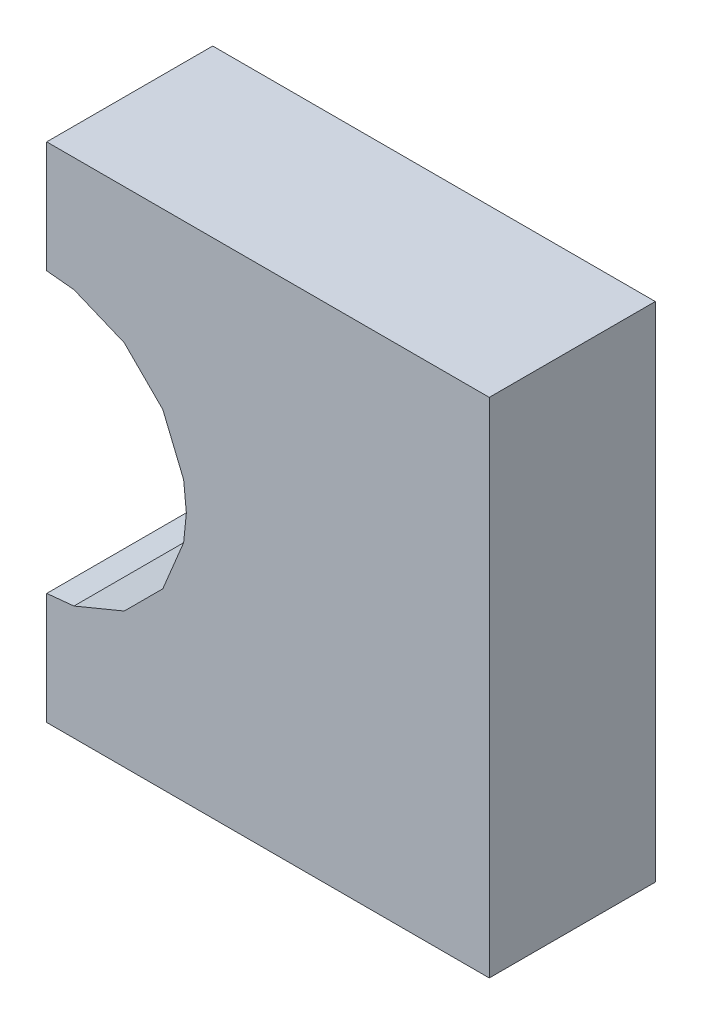
ISO-10303-21;
HEADER;
FILE_DESCRIPTION(('STEP AP214'),'2;1');
FILE_NAME('part.step','',(''),(''),'','','');
FILE_SCHEMA(('AUTOMOTIVE_DESIGN { 1 0 10303 214 1 1 1 1 }'));
ENDSEC;
DATA;
#1=APPLICATION_CONTEXT('core data for automotive mechanical design processes');
#2=APPLICATION_PROTOCOL_DEFINITION('international standard','automotive_design',2000,#1);
#3=PRODUCT_CONTEXT('',#1,'mechanical');
#4=PRODUCT('Part','Part','',(#3));
#5=PRODUCT_RELATED_PRODUCT_CATEGORY('part','',(#4));
#6=PRODUCT_DEFINITION_FORMATION('','',#4);
#7=PRODUCT_DEFINITION_CONTEXT('part definition',#1,'design');
#8=PRODUCT_DEFINITION('design','',#6,#7);
#9=PRODUCT_DEFINITION_SHAPE('','',#8);
#10=(LENGTH_UNIT() NAMED_UNIT(*) SI_UNIT(.MILLI.,.METRE.));
#11=(NAMED_UNIT(*) PLANE_ANGLE_UNIT() SI_UNIT($,.RADIAN.));
#12=(NAMED_UNIT(*) SI_UNIT($,.STERADIAN.) SOLID_ANGLE_UNIT());
#13=UNCERTAINTY_MEASURE_WITH_UNIT(LENGTH_MEASURE(1.E-05),#10,'distance_accuracy_value','');
#14=(GEOMETRIC_REPRESENTATION_CONTEXT(3) GLOBAL_UNCERTAINTY_ASSIGNED_CONTEXT((#13)) GLOBAL_UNIT_ASSIGNED_CONTEXT((#10,
#11,#12)) REPRESENTATION_CONTEXT('',''));
#15=CARTESIAN_POINT('',(0.,0.,0.));
#16=DIRECTION('',(0.,0.,1.));
#17=DIRECTION('',(1.,0.,0.));
#18=AXIS2_PLACEMENT_3D('',#15,#16,#17);
#19=CARTESIAN_POINT('',(0.001594846921477,3.9356421094E-06,0.1499997));
#20=DIRECTION('',(0.,0.,1.));
#21=DIRECTION('',(1.,0.,0.));
#22=AXIS2_PLACEMENT_3D('',#19,#20,#21);
#23=PLANE('',#22);
#24=DIRECTION('',(1.,0.,0.));
#25=VECTOR('',#24,1.);
#26=CARTESIAN_POINT('',(-0.19994118,-0.2271776,0.1499997));
#27=LINE('',#26,#25);
#28=CARTESIAN_POINT('',(-0.19994118,-0.2271776,0.1499997));
#29=VERTEX_POINT('',#28);
#30=CARTESIAN_POINT('',(0.19994626,-0.2271776,0.1499997));
#31=VERTEX_POINT('',#30);
#32=EDGE_CURVE('E20',#29,#31,#27,.T.);
#33=ORIENTED_EDGE('',*,*,#32,.T.);
#34=DIRECTION('',(0.,1.,0.));
#35=VECTOR('',#34,1.);
#36=CARTESIAN_POINT('',(0.19994626,-0.2271776,0.1499997));
#37=LINE('',#36,#35);
#38=CARTESIAN_POINT('',(0.19994626,0.22718014,0.1499997));
#39=VERTEX_POINT('',#38);
#40=EDGE_CURVE('E200',#31,#39,#37,.T.);
#41=ORIENTED_EDGE('',*,*,#40,.T.);
#42=DIRECTION('',(-1.,0.,0.));
#43=VECTOR('',#42,1.);
#44=CARTESIAN_POINT('',(0.19994626,0.22718014,0.1499997));
#45=LINE('',#44,#43);
#46=CARTESIAN_POINT('',(-0.19994118,0.22718014,0.1499997));
#47=VERTEX_POINT('',#46);
#48=EDGE_CURVE('E232',#39,#47,#45,.T.);
#49=ORIENTED_EDGE('',*,*,#48,.T.);
#50=DIRECTION('',(-2.51648293148192E-05,-0.999999999683366,0.));
#51=VECTOR('',#50,1.);
#52=CARTESIAN_POINT('',(-0.19994118,0.22718014,0.1499997));
#53=LINE('',#52,#51);
#54=CARTESIAN_POINT('',(-0.19994372,0.12624562,0.1499997));
#55=VERTEX_POINT('',#54);
#56=EDGE_CURVE('E112',#47,#55,#53,.T.);
#57=ORIENTED_EDGE('',*,*,#56,.T.);
#58=DIRECTION('',(0.995178530513557,-0.0980800306121363,0.));
#59=VECTOR('',#58,1.);
#60=CARTESIAN_POINT('',(-0.19994372,0.12624562,0.1499997));
#61=LINE('',#60,#59);
#62=CARTESIAN_POINT('',(-0.17533112,0.12381992,0.1499997));
#63=VERTEX_POINT('',#62);
#64=EDGE_CURVE('E92',#55,#63,#61,.T.);
#65=ORIENTED_EDGE('',*,*,#64,.T.);
#66=DIRECTION('',(0.92387029835817,-0.38270572482207,0.));
#67=VECTOR('',#66,1.);
#68=CARTESIAN_POINT('',(-0.17533112,0.12381992,0.1499997));
#69=LINE('',#68,#67);
#70=CARTESIAN_POINT('',(-0.12985242,0.10498074,0.1499997));
#71=VERTEX_POINT('',#70);
#72=EDGE_CURVE('E207',#63,#71,#69,.T.);
#73=ORIENTED_EDGE('',*,*,#72,.T.);
#74=DIRECTION('',(0.707106781187048,-0.707106781186048,0.));
#75=VECTOR('',#74,1.);
#76=CARTESIAN_POINT('',(-0.12985242,0.10498074,0.1499997));
#77=LINE('',#76,#75);
#78=CARTESIAN_POINT('',(-0.09504426000001,0.07017258000002,0.1499997));
#79=VERTEX_POINT('',#78);
#80=EDGE_CURVE('E217',#71,#79,#77,.T.);
#81=ORIENTED_EDGE('',*,*,#80,.T.);
#82=DIRECTION('',(0.382705724820863,-0.92387029835867,0.));
#83=VECTOR('',#82,1.);
#84=CARTESIAN_POINT('',(-0.09504426000001,0.07017258000002,0.1499997));
#85=LINE('',#84,#83);
#86=CARTESIAN_POINT('',(-0.07620508000002,0.02469388,0.1499997));
#87=VERTEX_POINT('',#86);
#88=EDGE_CURVE('E201',#79,#87,#85,.T.);
#89=ORIENTED_EDGE('',*,*,#88,.T.);
#90=DIRECTION('',(0.0980800306154527,-0.99517853051323,0.));
#91=VECTOR('',#90,1.);
#92=CARTESIAN_POINT('',(-0.07620508000002,0.02469388,0.1499997));
#93=LINE('',#92,#91);
#94=CARTESIAN_POINT('',(-0.07377937999996,8.127999998919E-05,0.1499997));
#95=VERTEX_POINT('',#94);
#96=EDGE_CURVE('E218',#87,#95,#93,.T.);
#97=ORIENTED_EDGE('',*,*,#96,.T.);
#98=DIRECTION('',(0.,-1.,0.));
#99=VECTOR('',#98,1.);
#100=CARTESIAN_POINT('',(-0.07377937999996,8.127999998919E-05,0.1499997));
#101=LINE('',#100,#99);
#102=CARTESIAN_POINT('',(-0.07377937999996,-2.540000025419E-06,0.1499997));
#103=VERTEX_POINT('',#102);
#104=EDGE_CURVE('E255',#95,#103,#101,.T.);
#105=ORIENTED_EDGE('',*,*,#104,.T.);
#106=DIRECTION('',(-0.098070007225142,-0.995179518319615,0.));
#107=VECTOR('',#106,1.);
#108=CARTESIAN_POINT('',(-0.07377937999996,-2.540000025419E-06,0.1499997));
#109=LINE('',#108,#107);
#110=CARTESIAN_POINT('',(-0.07620508000002,-0.02461768000001,0.1499997));
#111=VERTEX_POINT('',#110);
#112=EDGE_CURVE('E235',#103,#111,#109,.T.);
#113=ORIENTED_EDGE('',*,*,#112,.T.);
#114=DIRECTION('',(-0.38266168236186,-0.923888541357663,0.));
#115=VECTOR('',#114,1.);
#116=CARTESIAN_POINT('',(-0.07620508000002,-0.02461768000001,0.1499997));
#117=LINE('',#116,#115);
#118=CARTESIAN_POINT('',(-0.09504171999998,-0.07009638,0.1499997));
#119=VERTEX_POINT('',#118);
#120=EDGE_CURVE('E190',#111,#119,#117,.T.);
#121=ORIENTED_EDGE('',*,*,#120,.T.);
#122=DIRECTION('',(-0.707106781186548,-0.707106781186548,0.));
#123=VECTOR('',#122,1.);
#124=CARTESIAN_POINT('',(-0.09504171999998,-0.07009638,0.1499997));
#125=LINE('',#124,#123);
#126=CARTESIAN_POINT('',(-0.12984988,-0.10490454,0.1499997));
#127=VERTEX_POINT('',#126);
#128=EDGE_CURVE('E169',#119,#127,#125,.T.);
#129=ORIENTED_EDGE('',*,*,#128,.T.);
#130=DIRECTION('',(-0.923888541357163,-0.382661682363068,0.));
#131=VECTOR('',#130,1.);
#132=CARTESIAN_POINT('',(-0.12984988,-0.10490454,0.1499997));
#133=LINE('',#132,#131);
#134=CARTESIAN_POINT('',(-0.17532858,-0.12374118,0.1499997));
#135=VERTEX_POINT('',#134);
#136=EDGE_CURVE('E166',#127,#135,#133,.T.);
#137=ORIENTED_EDGE('',*,*,#136,.T.);
#138=DIRECTION('',(-0.995188549826162,-0.0979783154320458,0.));
#139=VECTOR('',#138,1.);
#140=CARTESIAN_POINT('',(-0.17532858,-0.12374118,0.1499997));
#141=LINE('',#140,#139);
#142=CARTESIAN_POINT('',(-0.19994118,-0.12616434,0.1499997));
#143=VERTEX_POINT('',#142);
#144=EDGE_CURVE('E154',#135,#143,#141,.T.);
#145=ORIENTED_EDGE('',*,*,#144,.T.);
#146=DIRECTION('',(0.,-1.,0.));
#147=VECTOR('',#146,1.);
#148=CARTESIAN_POINT('',(-0.19994118,-0.12616434,0.1499997));
#149=LINE('',#148,#147);
#150=EDGE_CURVE('E11',#143,#29,#149,.T.);
#151=ORIENTED_EDGE('',*,*,#150,.T.);
#152=EDGE_LOOP('',(#33,#41,#49,#57,#65,#73,#81,#89,#97,#105,#113,#121,#129,#137,#145,#151));
#153=FACE_BOUND('',#152,.T.);
#154=ADVANCED_FACE('F16',(#153),#23,.T.);
#155=CARTESIAN_POINT('',(0.001594846921477,3.9356421094E-06,0.));
#156=DIRECTION('',(0.,0.,1.));
#157=DIRECTION('',(1.,0.,0.));
#158=AXIS2_PLACEMENT_3D('',#155,#156,#157);
#159=PLANE('',#158);
#160=DIRECTION('',(1.,0.,0.));
#161=VECTOR('',#160,1.);
#162=CARTESIAN_POINT('',(-0.19994118,-0.2271776,0.));
#163=LINE('',#162,#161);
#164=CARTESIAN_POINT('',(-0.19994118,-0.2271776,0.));
#165=VERTEX_POINT('',#164);
#166=CARTESIAN_POINT('',(0.19994626,-0.2271776,0.));
#167=VERTEX_POINT('',#166);
#168=EDGE_CURVE('E244',#165,#167,#163,.T.);
#169=ORIENTED_EDGE('',*,*,#168,.F.);
#170=DIRECTION('',(0.,-1.,0.));
#171=VECTOR('',#170,1.);
#172=CARTESIAN_POINT('',(-0.19994118,-0.12616434,0.));
#173=LINE('',#172,#171);
#174=CARTESIAN_POINT('',(-0.19994118,-0.12616434,0.));
#175=VERTEX_POINT('',#174);
#176=EDGE_CURVE('E27',#175,#165,#173,.T.);
#177=ORIENTED_EDGE('',*,*,#176,.F.);
#178=DIRECTION('',(-0.995188549826162,-0.0979783154320458,0.));
#179=VECTOR('',#178,1.);
#180=CARTESIAN_POINT('',(-0.17532858,-0.12374118,0.));
#181=LINE('',#180,#179);
#182=CARTESIAN_POINT('',(-0.17532858,-0.12374118,0.));
#183=VERTEX_POINT('',#182);
#184=EDGE_CURVE('E174',#183,#175,#181,.T.);
#185=ORIENTED_EDGE('',*,*,#184,.F.);
#186=DIRECTION('',(-0.923888541357163,-0.382661682363068,0.));
#187=VECTOR('',#186,1.);
#188=CARTESIAN_POINT('',(-0.12984988,-0.10490454,0.));
#189=LINE('',#188,#187);
#190=CARTESIAN_POINT('',(-0.12984988,-0.10490454,0.));
#191=VERTEX_POINT('',#190);
#192=EDGE_CURVE('E178',#191,#183,#189,.T.);
#193=ORIENTED_EDGE('',*,*,#192,.F.);
#194=DIRECTION('',(-0.707106781186548,-0.707106781186548,0.));
#195=VECTOR('',#194,1.);
#196=CARTESIAN_POINT('',(-0.09504171999998,-0.07009638,0.));
#197=LINE('',#196,#195);
#198=CARTESIAN_POINT('',(-0.09504171999998,-0.07009638,0.));
#199=VERTEX_POINT('',#198);
#200=EDGE_CURVE('E193',#199,#191,#197,.T.);
#201=ORIENTED_EDGE('',*,*,#200,.F.);
#202=DIRECTION('',(-0.38266168236186,-0.923888541357663,0.));
#203=VECTOR('',#202,1.);
#204=CARTESIAN_POINT('',(-0.07620508000002,-0.02461768000001,0.));
#205=LINE('',#204,#203);
#206=CARTESIAN_POINT('',(-0.07620508000002,-0.02461768000001,0.));
#207=VERTEX_POINT('',#206);
#208=EDGE_CURVE('E239',#207,#199,#205,.T.);
#209=ORIENTED_EDGE('',*,*,#208,.F.);
#210=DIRECTION('',(-0.098070007225142,-0.995179518319615,0.));
#211=VECTOR('',#210,1.);
#212=CARTESIAN_POINT('',(-0.07377937999996,-2.540000025419E-06,0.));
#213=LINE('',#212,#211);
#214=CARTESIAN_POINT('',(-0.07377937999996,-2.540000025419E-06,0.));
#215=VERTEX_POINT('',#214);
#216=EDGE_CURVE('E247',#215,#207,#213,.T.);
#217=ORIENTED_EDGE('',*,*,#216,.F.);
#218=DIRECTION('',(0.,-1.,0.));
#219=VECTOR('',#218,1.);
#220=CARTESIAN_POINT('',(-0.07377937999996,8.127999998919E-05,0.));
#221=LINE('',#220,#219);
#222=CARTESIAN_POINT('',(-0.07377937999996,8.127999998919E-05,0.));
#223=VERTEX_POINT('',#222);
#224=EDGE_CURVE('E222',#223,#215,#221,.T.);
#225=ORIENTED_EDGE('',*,*,#224,.F.);
#226=DIRECTION('',(0.0980800306154527,-0.99517853051323,0.));
#227=VECTOR('',#226,1.);
#228=CARTESIAN_POINT('',(-0.07620508000002,0.02469388,0.));
#229=LINE('',#228,#227);
#230=CARTESIAN_POINT('',(-0.07620508000002,0.02469388,0.));
#231=VERTEX_POINT('',#230);
#232=EDGE_CURVE('E205',#231,#223,#229,.T.);
#233=ORIENTED_EDGE('',*,*,#232,.F.);
#234=DIRECTION('',(0.382705724820863,-0.92387029835867,0.));
#235=VECTOR('',#234,1.);
#236=CARTESIAN_POINT('',(-0.09504426000001,0.07017258000002,0.));
#237=LINE('',#236,#235);
#238=CARTESIAN_POINT('',(-0.09504426000001,0.07017258000002,0.));
#239=VERTEX_POINT('',#238);
#240=EDGE_CURVE('E270',#239,#231,#237,.T.);
#241=ORIENTED_EDGE('',*,*,#240,.F.);
#242=DIRECTION('',(0.707106781187048,-0.707106781186048,0.));
#243=VECTOR('',#242,1.);
#244=CARTESIAN_POINT('',(-0.12985242,0.10498074,0.));
#245=LINE('',#244,#243);
#246=CARTESIAN_POINT('',(-0.12985242,0.10498074,0.));
#247=VERTEX_POINT('',#246);
#248=EDGE_CURVE('E211',#247,#239,#245,.T.);
#249=ORIENTED_EDGE('',*,*,#248,.F.);
#250=DIRECTION('',(0.92387029835817,-0.38270572482207,0.));
#251=VECTOR('',#250,1.);
#252=CARTESIAN_POINT('',(-0.17533112,0.12381992,0.));
#253=LINE('',#252,#251);
#254=CARTESIAN_POINT('',(-0.17533112,0.12381992,0.));
#255=VERTEX_POINT('',#254);
#256=EDGE_CURVE('E278',#255,#247,#253,.T.);
#257=ORIENTED_EDGE('',*,*,#256,.F.);
#258=DIRECTION('',(0.995178530513557,-0.0980800306121363,0.));
#259=VECTOR('',#258,1.);
#260=CARTESIAN_POINT('',(-0.19994372,0.12624562,0.));
#261=LINE('',#260,#259);
#262=CARTESIAN_POINT('',(-0.19994372,0.12624562,0.));
#263=VERTEX_POINT('',#262);
#264=EDGE_CURVE('E102',#263,#255,#261,.T.);
#265=ORIENTED_EDGE('',*,*,#264,.F.);
#266=DIRECTION('',(-2.51648293148192E-05,-0.999999999683366,0.));
#267=VECTOR('',#266,1.);
#268=CARTESIAN_POINT('',(-0.19994118,0.22718014,0.));
#269=LINE('',#268,#267);
#270=CARTESIAN_POINT('',(-0.19994118,0.22718014,0.));
#271=VERTEX_POINT('',#270);
#272=EDGE_CURVE('E227',#271,#263,#269,.T.);
#273=ORIENTED_EDGE('',*,*,#272,.F.);
#274=DIRECTION('',(-1.,0.,0.));
#275=VECTOR('',#274,1.);
#276=CARTESIAN_POINT('',(0.19994626,0.22718014,0.));
#277=LINE('',#276,#275);
#278=CARTESIAN_POINT('',(0.19994626,0.22718014,0.));
#279=VERTEX_POINT('',#278);
#280=EDGE_CURVE('E195',#279,#271,#277,.T.);
#281=ORIENTED_EDGE('',*,*,#280,.F.);
#282=DIRECTION('',(0.,1.,0.));
#283=VECTOR('',#282,1.);
#284=CARTESIAN_POINT('',(0.19994626,-0.2271776,0.));
#285=LINE('',#284,#283);
#286=EDGE_CURVE('E346',#167,#279,#285,.T.);
#287=ORIENTED_EDGE('',*,*,#286,.F.);
#288=EDGE_LOOP('',(#169,#177,#185,#193,#201,#209,#217,#225,#233,#241,#249,#257,#265,#273,#281,#287));
#289=FACE_BOUND('',#288,.T.);
#290=ADVANCED_FACE('F370',(#289),#159,.F.);
#291=CARTESIAN_POINT('',(-0.19994118,-0.12616434,0.));
#292=DIRECTION('',(1.,0.,0.));
#293=DIRECTION('',(0.,1.,0.));
#294=AXIS2_PLACEMENT_3D('',#291,#292,#293);
#295=PLANE('',#294);
#296=DIRECTION('',(0.,0.,1.));
#297=VECTOR('',#296,1.);
#298=CARTESIAN_POINT('',(-0.19994118,-0.12616434,0.));
#299=LINE('',#298,#297);
#300=EDGE_CURVE('E161',#175,#143,#299,.T.);
#301=ORIENTED_EDGE('',*,*,#300,.F.);
#302=ORIENTED_EDGE('',*,*,#176,.T.);
#303=DIRECTION('',(0.,0.,1.));
#304=VECTOR('',#303,1.);
#305=CARTESIAN_POINT('',(-0.19994118,-0.2271776,0.));
#306=LINE('',#305,#304);
#307=EDGE_CURVE('E308',#165,#29,#306,.T.);
#308=ORIENTED_EDGE('',*,*,#307,.T.);
#309=ORIENTED_EDGE('',*,*,#150,.F.);
#310=EDGE_LOOP('',(#301,#302,#308,#309));
#311=FACE_BOUND('',#310,.T.);
#312=ADVANCED_FACE('F385',(#311),#295,.F.);
#313=CARTESIAN_POINT('',(-0.17532858,-0.12374118,0.));
#314=DIRECTION('',(0.0979783154320458,-0.995188549826162,0.));
#315=DIRECTION('',(0.,0.,-1.));
#316=AXIS2_PLACEMENT_3D('',#313,#314,#315);
#317=PLANE('',#316);
#318=DIRECTION('',(0.,0.,1.));
#319=VECTOR('',#318,1.);
#320=CARTESIAN_POINT('',(-0.17532858,-0.12374118,0.));
#321=LINE('',#320,#319);
#322=EDGE_CURVE('E159',#183,#135,#321,.T.);
#323=ORIENTED_EDGE('',*,*,#322,.F.);
#324=ORIENTED_EDGE('',*,*,#184,.T.);
#325=ORIENTED_EDGE('',*,*,#300,.T.);
#326=ORIENTED_EDGE('',*,*,#144,.F.);
#327=EDGE_LOOP('',(#323,#324,#325,#326));
#328=FACE_BOUND('',#327,.T.);
#329=ADVANCED_FACE('F156',(#328),#317,.F.);
#330=CARTESIAN_POINT('',(-0.12984988,-0.10490454,0.));
#331=DIRECTION('',(0.382661682363068,-0.923888541357163,0.));
#332=DIRECTION('',(0.,0.,-1.));
#333=AXIS2_PLACEMENT_3D('',#330,#331,#332);
#334=PLANE('',#333);
#335=DIRECTION('',(0.,0.,1.));
#336=VECTOR('',#335,1.);
#337=CARTESIAN_POINT('',(-0.12984988,-0.10490454,0.));
#338=LINE('',#337,#336);
#339=EDGE_CURVE('E231',#191,#127,#338,.T.);
#340=ORIENTED_EDGE('',*,*,#339,.F.);
#341=ORIENTED_EDGE('',*,*,#192,.T.);
#342=ORIENTED_EDGE('',*,*,#322,.T.);
#343=ORIENTED_EDGE('',*,*,#136,.F.);
#344=EDGE_LOOP('',(#340,#341,#342,#343));
#345=FACE_BOUND('',#344,.T.);
#346=ADVANCED_FACE('F176',(#345),#334,.F.);
#347=CARTESIAN_POINT('',(-0.09504171999998,-0.07009638,0.));
#348=DIRECTION('',(0.707106781186548,-0.707106781186548,0.));
#349=DIRECTION('',(0.,0.,-1.));
#350=AXIS2_PLACEMENT_3D('',#347,#348,#349);
#351=PLANE('',#350);
#352=DIRECTION('',(0.,0.,1.));
#353=VECTOR('',#352,1.);
#354=CARTESIAN_POINT('',(-0.09504171999998,-0.07009638,0.));
#355=LINE('',#354,#353);
#356=EDGE_CURVE('E194',#199,#119,#355,.T.);
#357=ORIENTED_EDGE('',*,*,#356,.F.);
#358=ORIENTED_EDGE('',*,*,#200,.T.);
#359=ORIENTED_EDGE('',*,*,#339,.T.);
#360=ORIENTED_EDGE('',*,*,#128,.F.);
#361=EDGE_LOOP('',(#357,#358,#359,#360));
#362=FACE_BOUND('',#361,.T.);
#363=ADVANCED_FACE('F523',(#362),#351,.F.);
#364=CARTESIAN_POINT('',(-0.07620508000002,-0.02461768000001,0.));
#365=DIRECTION('',(0.923888541357663,-0.382661682361861,0.));
#366=DIRECTION('',(0.,0.,-1.));
#367=AXIS2_PLACEMENT_3D('',#364,#365,#366);
#368=PLANE('',#367);
#369=DIRECTION('',(0.,0.,1.));
#370=VECTOR('',#369,1.);
#371=CARTESIAN_POINT('',(-0.07620508000002,-0.02461768000001,0.));
#372=LINE('',#371,#370);
#373=EDGE_CURVE('E240',#207,#111,#372,.T.);
#374=ORIENTED_EDGE('',*,*,#373,.F.);
#375=ORIENTED_EDGE('',*,*,#208,.T.);
#376=ORIENTED_EDGE('',*,*,#356,.T.);
#377=ORIENTED_EDGE('',*,*,#120,.F.);
#378=EDGE_LOOP('',(#374,#375,#376,#377));
#379=FACE_BOUND('',#378,.T.);
#380=ADVANCED_FACE('F538',(#379),#368,.F.);
#381=CARTESIAN_POINT('',(-0.07377937999996,-2.540000025419E-06,0.));
#382=DIRECTION('',(0.995179518319615,-0.098070007225142,0.));
#383=DIRECTION('',(0.,0.,-1.));
#384=AXIS2_PLACEMENT_3D('',#381,#382,#383);
#385=PLANE('',#384);
#386=DIRECTION('',(0.,0.,1.));
#387=VECTOR('',#386,1.);
#388=CARTESIAN_POINT('',(-0.07377937999996,-2.540000025419E-06,0.));
#389=LINE('',#388,#387);
#390=EDGE_CURVE('E188',#215,#103,#389,.T.);
#391=ORIENTED_EDGE('',*,*,#390,.F.);
#392=ORIENTED_EDGE('',*,*,#216,.T.);
#393=ORIENTED_EDGE('',*,*,#373,.T.);
#394=ORIENTED_EDGE('',*,*,#112,.F.);
#395=EDGE_LOOP('',(#391,#392,#393,#394));
#396=FACE_BOUND('',#395,.T.);
#397=ADVANCED_FACE('F330',(#396),#385,.F.);
#398=CARTESIAN_POINT('',(-0.07377937999996,8.127999998919E-05,0.));
#399=DIRECTION('',(1.,0.,0.));
#400=DIRECTION('',(0.,1.,0.));
#401=AXIS2_PLACEMENT_3D('',#398,#399,#400);
#402=PLANE('',#401);
#403=DIRECTION('',(0.,0.,1.));
#404=VECTOR('',#403,1.);
#405=CARTESIAN_POINT('',(-0.07377937999996,8.127999998919E-05,0.));
#406=LINE('',#405,#404);
#407=EDGE_CURVE('E223',#223,#95,#406,.T.);
#408=ORIENTED_EDGE('',*,*,#407,.F.);
#409=ORIENTED_EDGE('',*,*,#224,.T.);
#410=ORIENTED_EDGE('',*,*,#390,.T.);
#411=ORIENTED_EDGE('',*,*,#104,.F.);
#412=EDGE_LOOP('',(#408,#409,#410,#411));
#413=FACE_BOUND('',#412,.T.);
#414=ADVANCED_FACE('F327',(#413),#402,.F.);
#415=CARTESIAN_POINT('',(-0.07620508000002,0.02469388,0.));
#416=DIRECTION('',(0.99517853051323,0.0980800306154527,0.));
#417=DIRECTION('',(0.,0.,-1.));
#418=AXIS2_PLACEMENT_3D('',#415,#416,#417);
#419=PLANE('',#418);
#420=DIRECTION('',(0.,0.,1.));
#421=VECTOR('',#420,1.);
#422=CARTESIAN_POINT('',(-0.07620508000002,0.02469388,0.));
#423=LINE('',#422,#421);
#424=EDGE_CURVE('E206',#231,#87,#423,.T.);
#425=ORIENTED_EDGE('',*,*,#424,.F.);
#426=ORIENTED_EDGE('',*,*,#232,.T.);
#427=ORIENTED_EDGE('',*,*,#407,.T.);
#428=ORIENTED_EDGE('',*,*,#96,.F.);
#429=EDGE_LOOP('',(#425,#426,#427,#428));
#430=FACE_BOUND('',#429,.T.);
#431=ADVANCED_FACE('F336',(#430),#419,.F.);
#432=CARTESIAN_POINT('',(-0.09504426000001,0.07017258000002,0.));
#433=DIRECTION('',(0.92387029835867,0.382705724820863,0.));
#434=DIRECTION('',(0.,0.,-1.));
#435=AXIS2_PLACEMENT_3D('',#432,#433,#434);
#436=PLANE('',#435);
#437=DIRECTION('',(0.,0.,1.));
#438=VECTOR('',#437,1.);
#439=CARTESIAN_POINT('',(-0.09504426000001,0.07017258000002,0.));
#440=LINE('',#439,#438);
#441=EDGE_CURVE('E213',#239,#79,#440,.T.);
#442=ORIENTED_EDGE('',*,*,#441,.F.);
#443=ORIENTED_EDGE('',*,*,#240,.T.);
#444=ORIENTED_EDGE('',*,*,#424,.T.);
#445=ORIENTED_EDGE('',*,*,#88,.F.);
#446=EDGE_LOOP('',(#442,#443,#444,#445));
#447=FACE_BOUND('',#446,.T.);
#448=ADVANCED_FACE('F513',(#447),#436,.F.);
#449=CARTESIAN_POINT('',(-0.12985242,0.10498074,0.));
#450=DIRECTION('',(0.707106781186048,0.707106781187048,0.));
#451=DIRECTION('',(0.,0.,-1.));
#452=AXIS2_PLACEMENT_3D('',#449,#450,#451);
#453=PLANE('',#452);
#454=DIRECTION('',(0.,0.,1.));
#455=VECTOR('',#454,1.);
#456=CARTESIAN_POINT('',(-0.12985242,0.10498074,0.));
#457=LINE('',#456,#455);
#458=EDGE_CURVE('E212',#247,#71,#457,.T.);
#459=ORIENTED_EDGE('',*,*,#458,.F.);
#460=ORIENTED_EDGE('',*,*,#248,.T.);
#461=ORIENTED_EDGE('',*,*,#441,.T.);
#462=ORIENTED_EDGE('',*,*,#80,.F.);
#463=EDGE_LOOP('',(#459,#460,#461,#462));
#464=FACE_BOUND('',#463,.T.);
#465=ADVANCED_FACE('F504',(#464),#453,.F.);
#466=CARTESIAN_POINT('',(-0.17533112,0.12381992,0.));
#467=DIRECTION('',(0.38270572482207,0.92387029835817,0.));
#468=DIRECTION('',(0.,0.,-1.));
#469=AXIS2_PLACEMENT_3D('',#466,#467,#468);
#470=PLANE('',#469);
#471=DIRECTION('',(0.,0.,1.));
#472=VECTOR('',#471,1.);
#473=CARTESIAN_POINT('',(-0.17533112,0.12381992,0.));
#474=LINE('',#473,#472);
#475=EDGE_CURVE('E289',#255,#63,#474,.T.);
#476=ORIENTED_EDGE('',*,*,#475,.F.);
#477=ORIENTED_EDGE('',*,*,#256,.T.);
#478=ORIENTED_EDGE('',*,*,#458,.T.);
#479=ORIENTED_EDGE('',*,*,#72,.F.);
#480=EDGE_LOOP('',(#476,#477,#478,#479));
#481=FACE_BOUND('',#480,.T.);
#482=ADVANCED_FACE('F498',(#481),#470,.F.);
#483=CARTESIAN_POINT('',(-0.19994372,0.12624562,0.));
#484=DIRECTION('',(0.0980800306121363,0.995178530513557,0.));
#485=DIRECTION('',(0.,0.,-1.));
#486=AXIS2_PLACEMENT_3D('',#483,#484,#485);
#487=PLANE('',#486);
#488=DIRECTION('',(0.,0.,1.));
#489=VECTOR('',#488,1.);
#490=CARTESIAN_POINT('',(-0.19994372,0.12624562,0.));
#491=LINE('',#490,#489);
#492=EDGE_CURVE('E224',#263,#55,#491,.T.);
#493=ORIENTED_EDGE('',*,*,#492,.F.);
#494=ORIENTED_EDGE('',*,*,#264,.T.);
#495=ORIENTED_EDGE('',*,*,#475,.T.);
#496=ORIENTED_EDGE('',*,*,#64,.F.);
#497=EDGE_LOOP('',(#493,#494,#495,#496));
#498=FACE_BOUND('',#497,.T.);
#499=ADVANCED_FACE('F503',(#498),#487,.F.);
#500=CARTESIAN_POINT('',(-0.19994118,0.22718014,0.));
#501=DIRECTION('',(0.999999999683366,-2.51648293148192E-05,0.));
#502=DIRECTION('',(0.,0.,-1.));
#503=AXIS2_PLACEMENT_3D('',#500,#501,#502);
#504=PLANE('',#503);
#505=DIRECTION('',(0.,0.,1.));
#506=VECTOR('',#505,1.);
#507=CARTESIAN_POINT('',(-0.19994118,0.22718014,0.));
#508=LINE('',#507,#506);
#509=EDGE_CURVE('E199',#271,#47,#508,.T.);
#510=ORIENTED_EDGE('',*,*,#509,.F.);
#511=ORIENTED_EDGE('',*,*,#272,.T.);
#512=ORIENTED_EDGE('',*,*,#492,.T.);
#513=ORIENTED_EDGE('',*,*,#56,.F.);
#514=EDGE_LOOP('',(#510,#511,#512,#513));
#515=FACE_BOUND('',#514,.T.);
#516=ADVANCED_FACE('F18',(#515),#504,.F.);
#517=CARTESIAN_POINT('',(0.19994626,0.22718014,0.));
#518=DIRECTION('',(0.,-1.,0.));
#519=DIRECTION('',(0.,0.,-1.));
#520=AXIS2_PLACEMENT_3D('',#517,#518,#519);
#521=PLANE('',#520);
#522=DIRECTION('',(0.,0.,1.));
#523=VECTOR('',#522,1.);
#524=CARTESIAN_POINT('',(0.19994626,0.22718014,0.));
#525=LINE('',#524,#523);
#526=EDGE_CURVE('E350',#279,#39,#525,.T.);
#527=ORIENTED_EDGE('',*,*,#526,.F.);
#528=ORIENTED_EDGE('',*,*,#280,.T.);
#529=ORIENTED_EDGE('',*,*,#509,.T.);
#530=ORIENTED_EDGE('',*,*,#48,.F.);
#531=EDGE_LOOP('',(#527,#528,#529,#530));
#532=FACE_BOUND('',#531,.T.);
#533=ADVANCED_FACE('F376',(#532),#521,.F.);
#534=CARTESIAN_POINT('',(0.19994626,-0.2271776,0.));
#535=DIRECTION('',(-1.,0.,0.));
#536=DIRECTION('',(0.,0.,1.));
#537=AXIS2_PLACEMENT_3D('',#534,#535,#536);
#538=PLANE('',#537);
#539=DIRECTION('',(0.,0.,1.));
#540=VECTOR('',#539,1.);
#541=CARTESIAN_POINT('',(0.19994626,-0.2271776,0.));
#542=LINE('',#541,#540);
#543=EDGE_CURVE('E241',#167,#31,#542,.T.);
#544=ORIENTED_EDGE('',*,*,#543,.F.);
#545=ORIENTED_EDGE('',*,*,#286,.T.);
#546=ORIENTED_EDGE('',*,*,#526,.T.);
#547=ORIENTED_EDGE('',*,*,#40,.F.);
#548=EDGE_LOOP('',(#544,#545,#546,#547));
#549=FACE_BOUND('',#548,.T.);
#550=ADVANCED_FACE('F378',(#549),#538,.F.);
#551=CARTESIAN_POINT('',(-0.19994118,-0.2271776,0.));
#552=DIRECTION('',(0.,1.,0.));
#553=DIRECTION('',(1.,0.,0.));
#554=AXIS2_PLACEMENT_3D('',#551,#552,#553);
#555=PLANE('',#554);
#556=ORIENTED_EDGE('',*,*,#307,.F.);
#557=ORIENTED_EDGE('',*,*,#168,.T.);
#558=ORIENTED_EDGE('',*,*,#543,.T.);
#559=ORIENTED_EDGE('',*,*,#32,.F.);
#560=EDGE_LOOP('',(#556,#557,#558,#559));
#561=FACE_BOUND('',#560,.T.);
#562=ADVANCED_FACE('F384',(#561),#555,.F.);
#563=CLOSED_SHELL('',(#154,#290,#312,#329,#346,#363,#380,#397,#414,#431,#448,#465,#482,#499,
#516,#533,#550,#562));
#564=MANIFOLD_SOLID_BREP('B1',#563);
#565=ADVANCED_BREP_SHAPE_REPRESENTATION('',(#18,#564),#14);
#566=SHAPE_DEFINITION_REPRESENTATION(#9,#565);
ENDSEC;
END-ISO-10303-21;
